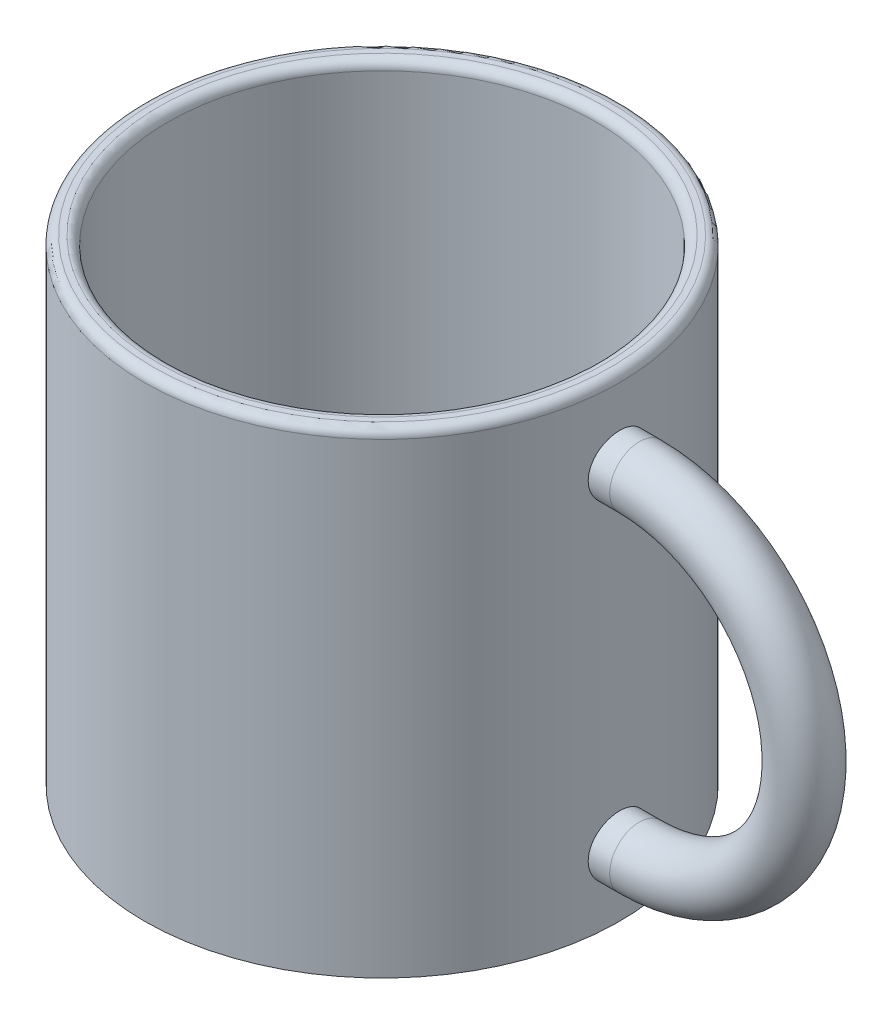
ISO-10303-21;
HEADER;
FILE_DESCRIPTION(('STEP AP214'),'2;1');
FILE_NAME('part.step','',(''),(''),'','','');
FILE_SCHEMA(('AUTOMOTIVE_DESIGN { 1 0 10303 214 1 1 1 1 }'));
ENDSEC;
DATA;
#1=APPLICATION_CONTEXT('core data for automotive mechanical design processes');
#2=APPLICATION_PROTOCOL_DEFINITION('international standard','automotive_design',2000,#1);
#3=PRODUCT_CONTEXT('',#1,'mechanical');
#4=PRODUCT('Part','Part','',(#3));
#5=PRODUCT_RELATED_PRODUCT_CATEGORY('part','',(#4));
#6=PRODUCT_DEFINITION_FORMATION('','',#4);
#7=PRODUCT_DEFINITION_CONTEXT('part definition',#1,'design');
#8=PRODUCT_DEFINITION('design','',#6,#7);
#9=PRODUCT_DEFINITION_SHAPE('','',#8);
#10=(LENGTH_UNIT() NAMED_UNIT(*) SI_UNIT(.MILLI.,.METRE.));
#11=(NAMED_UNIT(*) PLANE_ANGLE_UNIT() SI_UNIT($,.RADIAN.));
#12=(NAMED_UNIT(*) SI_UNIT($,.STERADIAN.) SOLID_ANGLE_UNIT());
#13=UNCERTAINTY_MEASURE_WITH_UNIT(LENGTH_MEASURE(1.E-05),#10,'distance_accuracy_value','');
#14=(GEOMETRIC_REPRESENTATION_CONTEXT(3) GLOBAL_UNCERTAINTY_ASSIGNED_CONTEXT((#13)) GLOBAL_UNIT_ASSIGNED_CONTEXT((#10,
#11,#12)) REPRESENTATION_CONTEXT('',''));
#15=CARTESIAN_POINT('',(0.,0.,0.));
#16=DIRECTION('',(0.,0.,1.));
#17=DIRECTION('',(1.,0.,0.));
#18=AXIS2_PLACEMENT_3D('',#15,#16,#17);
#19=CARTESIAN_POINT('',(-1.76082079814359,58.5636991900341,2.01932129809792E-06));
#20=DIRECTION('',(0.,-1.,0.));
#21=DIRECTION('',(0.,0.,-1.));
#22=AXIS2_PLACEMENT_3D('',#19,#20,#21);
#23=CYLINDRICAL_SURFACE('',#22,36.);
#24=CARTESIAN_POINT('',(-1.76082079814359,57.2136991900341,2.01932129809792E-06));
#25=DIRECTION('',(0.,1.,0.));
#26=DIRECTION('',(0.,0.,1.));
#27=AXIS2_PLACEMENT_3D('',#24,#25,#26);
#28=CIRCLE('',#27,36.);
#29=CARTESIAN_POINT('',(-1.76082079814359,57.2136991900341,36.0000020193213));
#30=VERTEX_POINT('',#29);
#31=EDGE_CURVE('E49',#30,#30,#28,.F.);
#32=ORIENTED_EDGE('',*,*,#31,.T.);
#33=EDGE_LOOP('',(#32));
#34=FACE_BOUND('',#33,.T.);
#35=CARTESIAN_POINT('',(33.9568219012284,-3.44089809503379,4.5000020193213));
#36=CARTESIAN_POINT('',(33.9568255164976,-3.18919278419296,4.49999131802138));
#37=CARTESIAN_POINT('',(33.9595113118363,-2.9373301581587,4.47881223755117));
#38=CARTESIAN_POINT('',(33.969960237254,-2.44061428926255,4.3946595640113));
#39=CARTESIAN_POINT('',(33.977728672829,-2.19576865013058,4.33164229728475));
#40=CARTESIAN_POINT('',(33.9974495304141,-1.72035030724008,4.16570006641122));
#41=CARTESIAN_POINT('',(34.0093991121829,-1.48976803922425,4.06280218795899));
#42=CARTESIAN_POINT('',(34.036132425054,-1.04918688174818,3.82007757649359));
#43=CARTESIAN_POINT('',(34.0509156715303,-0.839184481895194,3.68025715659569));
#44=CARTESIAN_POINT('',(34.08174326829,-0.444506050215049,3.36681822979748));
#45=CARTESIAN_POINT('',(34.0977935525048,-0.259961850860085,3.1930342863651));
#46=CARTESIAN_POINT('',(34.1292933936098,0.0774228890568443,2.81695748852945));
#47=CARTESIAN_POINT('',(34.1447429205822,0.230261852336736,2.61466321662574));
#48=CARTESIAN_POINT('',(34.1733612048903,0.500370348077595,2.18647971453806));
#49=CARTESIAN_POINT('',(34.1865222510998,0.617520586145584,1.96051467133131));
#50=CARTESIAN_POINT('',(34.2090154670371,0.812162064859977,1.49192611182194));
#51=CARTESIAN_POINT('',(34.2183477788696,0.889654777433953,1.24930321417093));
#52=CARTESIAN_POINT('',(34.2320902385687,1.00238762796818,0.755634257273301));
#53=CARTESIAN_POINT('',(34.2365259089034,1.03784692630922,0.504638966715378));
#54=CARTESIAN_POINT('',(34.2400624569823,1.06618559803199,0.000223780557080926));
#55=CARTESIAN_POINT('',(34.2391635445938,1.05906664648079,-0.253196019269291));
#56=CARTESIAN_POINT('',(34.2321528617166,1.00262654000285,-0.753775464832889));
#57=CARTESIAN_POINT('',(34.2260702060595,0.95354108769974,-1.00096215105472));
#58=CARTESIAN_POINT('',(34.2094082088184,0.814929787032335,-1.48356187570838));
#59=CARTESIAN_POINT('',(34.1988287817492,0.725403169865922,-1.71897469021987));
#60=CARTESIAN_POINT('',(34.1743118423989,0.508200217955404,-2.17207384846825));
#61=CARTESIAN_POINT('',(34.1603653710347,0.38042188105189,-2.38971079079164));
#62=CARTESIAN_POINT('',(34.1306746450315,0.0904168529773623,-2.80054139483036));
#63=CARTESIAN_POINT('',(34.1149303079571,-0.0718114180772167,-2.99373393486995));
#64=CARTESIAN_POINT('',(34.0832788172796,-0.427431368510873,-3.35157643607001));
#65=CARTESIAN_POINT('',(34.0673712863415,-0.621028462217781,-3.5160222926715));
#66=CARTESIAN_POINT('',(34.0372924967868,-1.0331848972422,-3.8101171118039));
#67=CARTESIAN_POINT('',(34.0231212436128,-1.25174431680229,-3.93976596526188));
#68=CARTESIAN_POINT('',(33.9981196488853,-1.70780318704597,-4.16059821312763));
#69=CARTESIAN_POINT('',(33.9872907282028,-1.94531063894955,-4.25176525443089));
#70=CARTESIAN_POINT('',(33.9702275667836,-2.43242911138208,-4.39286495872126));
#71=CARTESIAN_POINT('',(33.9639931046171,-2.68203954798948,-4.44279960891802));
#72=CARTESIAN_POINT('',(33.9568651999693,-3.18447582263336,-4.4997467581142));
#73=CARTESIAN_POINT('',(33.9559360158192,-3.43726861659361,-4.50704649627562));
#74=CARTESIAN_POINT('',(33.9594293420101,-3.94047356843153,-4.47927449649371));
#75=CARTESIAN_POINT('',(33.9638517382825,-4.19088577693655,-4.44420366167636));
#76=CARTESIAN_POINT('',(33.9775173145681,-4.68136046947394,-4.33292789511461));
#77=CARTESIAN_POINT('',(33.9867441903603,-4.92145500237652,-4.25686205142161));
#78=CARTESIAN_POINT('',(34.0089658613309,-5.38548157376947,-4.06589867508774));
#79=CARTESIAN_POINT('',(34.0219607888901,-5.60941304406735,-3.95099977812491));
#80=CARTESIAN_POINT('',(34.0503399662146,-6.03605645389717,-3.68492562055756));
#81=CARTESIAN_POINT('',(34.0657364711239,-6.23865009259975,-3.5335619959175));
#82=CARTESIAN_POINT('',(34.0971455137748,-6.61565989211684,-3.19912131694282));
#83=CARTESIAN_POINT('',(34.1131580754596,-6.79007495639616,-3.01604302904457));
#84=CARTESIAN_POINT('',(34.1441047982217,-7.10678563223572,-2.62211517668404));
#85=CARTESIAN_POINT('',(34.1590322922818,-7.24889249926477,-2.41111326648936));
#86=CARTESIAN_POINT('',(34.1860272364254,-7.49564688677462,-1.96806862770592));
#87=CARTESIAN_POINT('',(34.1980947441553,-7.60029516229954,-1.73602632334168));
#88=CARTESIAN_POINT('',(34.2179804336138,-7.76885011146824,-1.25811492712972));
#89=CARTESIAN_POINT('',(34.225809984235,-7.83286586789069,-1.0122848003999));
#90=CARTESIAN_POINT('',(34.2363847860526,-7.91869345564195,-0.513260883779028));
#91=CARTESIAN_POINT('',(34.2391302665198,-7.9405071901124,-0.26006742646729));
#92=CARTESIAN_POINT('',(34.2392265061022,-7.94127595515967,0.244652949340107));
#93=CARTESIAN_POINT('',(34.2366138988768,-7.92052202405617,0.496179467207807));
#94=CARTESIAN_POINT('',(34.2263603427,-7.83736099085826,0.992139953936017));
#95=CARTESIAN_POINT('',(34.2187193972456,-7.77495391773251,1.23657392772908));
#96=CARTESIAN_POINT('',(34.1992639356704,-7.61034948920445,1.71137261669842));
#97=CARTESIAN_POINT('',(34.1874508816672,-7.50816607216241,1.94174222760833));
#98=CARTESIAN_POINT('',(34.1609592587791,-7.26693972873977,2.38211002618074));
#99=CARTESIAN_POINT('',(34.1462806558286,-7.12789636416117,2.59210797162049));
#100=CARTESIAN_POINT('',(34.1155766924805,-6.81582030742988,2.98725820165317));
#101=CARTESIAN_POINT('',(34.0995431447411,-6.64257106669712,3.17223883742028));
#102=CARTESIAN_POINT('',(34.068002064236,-6.26745079577593,3.51061603319888));
#103=CARTESIAN_POINT('',(34.0524946569697,-6.06557299552811,3.66400510135987));
#104=CARTESIAN_POINT('',(34.0236978064513,-5.63803223419719,3.93535145584204));
#105=CARTESIAN_POINT('',(34.010417159493,-5.41228043322605,4.05316962898663));
#106=CARTESIAN_POINT('',(33.9876806461809,-4.94415596203924,4.24905553830476));
#107=CARTESIAN_POINT('',(33.9782206222651,-4.7018016963076,4.32716650752439));
#108=CARTESIAN_POINT('',(33.9664933648563,-4.28864411834526,4.42272063255421));
#109=CARTESIAN_POINT('',(33.9628846292365,-4.12044678226224,4.4516594751413));
#110=CARTESIAN_POINT('',(33.9580476820091,-3.78182304509723,4.49030371995026));
#111=CARTESIAN_POINT('',(33.9568194523399,-3.61139666093754,4.50000926810077));
#112=CARTESIAN_POINT('',(33.9568219012284,-3.44089809503379,4.5000020193213));
#113=B_SPLINE_CURVE_WITH_KNOTS('',3,(#35,#36,#37,#38,#39,#40,#41,#42,#43,#44,#45,#46,#47,#48,
#49,#50,#51,#52,#53,#54,#55,#56,#57,#58,#59,#60,#61,#62,#63,#64,#65,#66,#67,#68,#69,#70,#71,#72,
#73,#74,#75,#76,#77,#78,#79,#80,#81,#82,#83,#84,#85,#86,#87,#88,#89,#90,#91,#92,#93,#94,#95,#96,
#97,#98,#99,#100,#101,#102,#103,#104,#105,#106,#107,#108,#109,#110,#111,#112),.UNSPECIFIED.,.T.,
.F.,(4,2,2,2,2,2,2,2,2,2,2,2,2,2,2,2,2,2,2,2,2,2,2,2,2,2,2,2,2,2,2,2,2,2,2,2,2,2,4),(0.,
0.754493071484989,1.50977497711771,2.26454481468959,3.01918568315446,3.77759839592661,
4.53604882940985,5.29700735066676,6.05793762616037,6.81488274498966,7.57179808510538,
8.32448996883812,9.07719616213564,9.8319276794739,10.5866938164873,11.3466185528433,
12.1065456711931,12.8667954013456,13.6270084888548,14.3820939205493,15.1371632579315,
15.8896867733126,16.6422367298568,17.3987607518374,18.15531420595,18.9161799461056,
19.6770303488032,20.4358294221724,21.194594275954,21.948188693232,22.7017825864056,
23.4551126438371,24.2084516573999,24.9667223200785,25.7251725979604,26.4865517587428,
27.2471001477468,27.7581778134636,28.2692516014691),.UNSPECIFIED.);
#114=CARTESIAN_POINT('',(33.9568219012284,-3.44089809503379,4.5000020193213));
#115=VERTEX_POINT('',#114);
#116=EDGE_CURVE('E61',#115,#115,#113,.T.);
#117=ORIENTED_EDGE('',*,*,#116,.T.);
#118=EDGE_LOOP('',(#117));
#119=FACE_BOUND('',#118,.T.);
#120=CARTESIAN_POINT('',(-1.76082079814359,-13.4363008099659,2.01932129809792E-06));
#121=DIRECTION('',(0.,1.,0.));
#122=DIRECTION('',(0.,0.,1.));
#123=AXIS2_PLACEMENT_3D('',#120,#121,#122);
#124=CIRCLE('',#123,36.);
#125=CARTESIAN_POINT('',(-1.76082079814359,-13.4363008099659,36.0000020193213));
#126=VERTEX_POINT('',#125);
#127=EDGE_CURVE('E67',#126,#126,#124,.T.);
#128=ORIENTED_EDGE('',*,*,#127,.T.);
#129=EDGE_LOOP('',(#128));
#130=FACE_BOUND('',#129,.T.);
#131=CARTESIAN_POINT('',(33.9568219012284,46.4551019049662,4.5000020193213));
#132=CARTESIAN_POINT('',(33.9568255164976,46.2033965941254,4.49999131802138));
#133=CARTESIAN_POINT('',(33.9595113118363,45.9515339680911,4.47881223755117));
#134=CARTESIAN_POINT('',(33.969960237254,45.454818099195,4.3946595640113));
#135=CARTESIAN_POINT('',(33.977728672829,45.209972460063,4.33164229728475));
#136=CARTESIAN_POINT('',(33.9974495304141,44.7345541171725,4.16570006641122));
#137=CARTESIAN_POINT('',(34.0093991121829,44.5039718491567,4.06280218795899));
#138=CARTESIAN_POINT('',(34.036132425054,44.0633906916806,3.82007757649359));
#139=CARTESIAN_POINT('',(34.0509156715303,43.8533882918276,3.68025715659569));
#140=CARTESIAN_POINT('',(34.08174326829,43.4587098601475,3.36681822979748));
#141=CARTESIAN_POINT('',(34.0977935525048,43.2741656607925,3.1930342863651));
#142=CARTESIAN_POINT('',(34.1292933936098,42.9367809208756,2.81695748852945));
#143=CARTESIAN_POINT('',(34.1447429205822,42.7839419575957,2.61466321662575));
#144=CARTESIAN_POINT('',(34.1733612048903,42.5138334618548,2.18647971453807));
#145=CARTESIAN_POINT('',(34.1865222510998,42.3966832237869,1.96051467133131));
#146=CARTESIAN_POINT('',(34.2090154670371,42.2020417450725,1.49192611182195));
#147=CARTESIAN_POINT('',(34.2183477788696,42.1245490324985,1.24930321417093));
#148=CARTESIAN_POINT('',(34.2320902385687,42.0118161819642,0.755634257273308));
#149=CARTESIAN_POINT('',(34.2365259089034,41.9763568836232,0.504638966715384));
#150=CARTESIAN_POINT('',(34.2400624569823,41.9480182119004,0.000223780557086618));
#151=CARTESIAN_POINT('',(34.2391635445938,41.9551371634516,-0.253196019269285));
#152=CARTESIAN_POINT('',(34.2321528617166,42.0115772699296,-0.753775464832882));
#153=CARTESIAN_POINT('',(34.2260702060595,42.0606627222327,-1.00096215105471));
#154=CARTESIAN_POINT('',(34.2094082088184,42.1992740229001,-1.48356187570837));
#155=CARTESIAN_POINT('',(34.1988287817492,42.2888006400665,-1.71897469021987));
#156=CARTESIAN_POINT('',(34.1743118423989,42.506003591977,-2.17207384846825));
#157=CARTESIAN_POINT('',(34.1603653710347,42.6337819288805,-2.38971079079163));
#158=CARTESIAN_POINT('',(34.1306746450315,42.9237869569551,-2.80054139483036));
#159=CARTESIAN_POINT('',(34.1149303079571,43.0860152280096,-2.99373393486994));
#160=CARTESIAN_POINT('',(34.0832788172796,43.4416351784433,-3.35157643607));
#161=CARTESIAN_POINT('',(34.0673712863415,43.6352322721502,-3.51602229267149));
#162=CARTESIAN_POINT('',(34.0372924967868,44.0473887071746,-3.81011711180389));
#163=CARTESIAN_POINT('',(34.0231212436128,44.2659481267347,-3.93976596526187));
#164=CARTESIAN_POINT('',(33.9981196488853,44.7220069969784,-4.16059821312763));
#165=CARTESIAN_POINT('',(33.9872907282028,44.959514448882,-4.25176525443089));
#166=CARTESIAN_POINT('',(33.9702275667836,45.4466329213145,-4.39286495872126));
#167=CARTESIAN_POINT('',(33.9639931046171,45.6962433579219,-4.44279960891802));
#168=CARTESIAN_POINT('',(33.9568651999693,46.1986796325658,-4.4997467581142));
#169=CARTESIAN_POINT('',(33.9559360158192,46.451472426526,-4.50704649627562));
#170=CARTESIAN_POINT('',(33.9594293420101,46.9546773783639,-4.47927449649371));
#171=CARTESIAN_POINT('',(33.9638517382825,47.205089586869,-4.44420366167636));
#172=CARTESIAN_POINT('',(33.9775173145681,47.6955642794064,-4.33292789511462));
#173=CARTESIAN_POINT('',(33.9867441903603,47.9356588123089,-4.25686205142162));
#174=CARTESIAN_POINT('',(34.0089658613309,48.3996853837019,-4.06589867508774));
#175=CARTESIAN_POINT('',(34.0219607888901,48.6236168539998,-3.95099977812492));
#176=CARTESIAN_POINT('',(34.0503399662146,49.0502602638296,-3.68492562055757));
#177=CARTESIAN_POINT('',(34.0657364711239,49.2528539025322,-3.5335619959175));
#178=CARTESIAN_POINT('',(34.0971455137748,49.6298637020493,-3.19912131694283));
#179=CARTESIAN_POINT('',(34.1131580754596,49.8042787663286,-3.01604302904457));
#180=CARTESIAN_POINT('',(34.1441047982217,50.1209894421681,-2.62211517668404));
#181=CARTESIAN_POINT('',(34.1590322922818,50.2630963091972,-2.41111326648937));
#182=CARTESIAN_POINT('',(34.1860272364254,50.509850696707,-1.96806862770593));
#183=CARTESIAN_POINT('',(34.1980947441553,50.614498972232,-1.73602632334168));
#184=CARTESIAN_POINT('',(34.2179804336138,50.7830539214007,-1.25811492712972));
#185=CARTESIAN_POINT('',(34.225809984235,50.8470696778231,-1.01228480039991));
#186=CARTESIAN_POINT('',(34.2363847860526,50.9328972655744,-0.513260883779037));
#187=CARTESIAN_POINT('',(34.2391302665198,50.9547110000448,-0.2600674264673));
#188=CARTESIAN_POINT('',(34.2392265061022,50.9554797650921,0.244652949340095));
#189=CARTESIAN_POINT('',(34.2366138988768,50.9347258339886,0.496179467207796));
#190=CARTESIAN_POINT('',(34.2263603427,50.8515648007907,0.992139953936007));
#191=CARTESIAN_POINT('',(34.2187193972456,50.7891577276649,1.23657392772907));
#192=CARTESIAN_POINT('',(34.1992639356704,50.6245532991369,1.71137261669841));
#193=CARTESIAN_POINT('',(34.1874508816672,50.5223698820948,1.94174222760833));
#194=CARTESIAN_POINT('',(34.1609592587791,50.2811435386722,2.38211002618073));
#195=CARTESIAN_POINT('',(34.1462806558286,50.1421001740936,2.59210797162048));
#196=CARTESIAN_POINT('',(34.1155766924805,49.8300241173623,2.98725820165316));
#197=CARTESIAN_POINT('',(34.0995431447411,49.6567748766296,3.17223883742028));
#198=CARTESIAN_POINT('',(34.068002064236,49.2816546057084,3.51061603319887));
#199=CARTESIAN_POINT('',(34.0524946569697,49.0797768054606,3.66400510135986));
#200=CARTESIAN_POINT('',(34.0236978064513,48.6522360441296,3.93535145584204));
#201=CARTESIAN_POINT('',(34.010417159493,48.4264842431585,4.05316962898663));
#202=CARTESIAN_POINT('',(33.9876806461809,47.9583597719717,4.24905553830476));
#203=CARTESIAN_POINT('',(33.9782206222651,47.71600550624,4.32716650752438));
#204=CARTESIAN_POINT('',(33.9664933648563,47.3028479282777,4.4227206325542));
#205=CARTESIAN_POINT('',(33.9628846292365,47.1346505921947,4.4516594751413));
#206=CARTESIAN_POINT('',(33.9580476820091,46.7960268550297,4.49030371995026));
#207=CARTESIAN_POINT('',(33.9568194523399,46.62560047087,4.50000926810077));
#208=CARTESIAN_POINT('',(33.9568219012284,46.4551019049662,4.5000020193213));
#209=B_SPLINE_CURVE_WITH_KNOTS('',3,(#131,#132,#133,#134,#135,#136,#137,#138,#139,#140,#141,
#142,#143,#144,#145,#146,#147,#148,#149,#150,#151,#152,#153,#154,#155,#156,#157,#158,#159,#160,
#161,#162,#163,#164,#165,#166,#167,#168,#169,#170,#171,#172,#173,#174,#175,#176,#177,#178,#179,
#180,#181,#182,#183,#184,#185,#186,#187,#188,#189,#190,#191,#192,#193,#194,#195,#196,#197,#198,
#199,#200,#201,#202,#203,#204,#205,#206,#207,#208),.UNSPECIFIED.,.T.,.F.,(4,2,2,2,2,2,2,2,2,2,2,
2,2,2,2,2,2,2,2,2,2,2,2,2,2,2,2,2,2,2,2,2,2,2,2,2,2,2,4),(0.,0.754493071484989,1.50977497711771,
2.26454481468958,3.01918568315445,3.77759839592661,4.53604882940984,5.29700735066676,
6.05793762616037,6.81488274498966,7.57179808510538,8.32448996883812,9.07719616213563,
9.8319276794739,10.5866938164873,11.3466185528433,12.1065456711931,12.8667954013456,
13.6270084888548,14.3820939205493,15.1371632579315,15.8896867733126,16.6422367298568,
17.3987607518374,18.15531420595,18.9161799461056,19.6770303488032,20.4358294221724,
21.194594275954,21.948188693232,22.7017825864056,23.4551126438371,24.2084516573999,
24.9667223200785,25.7251725979604,26.4865517587428,27.2471001477468,27.7581778134636,
28.2692516014691),.UNSPECIFIED.);
#210=CARTESIAN_POINT('',(33.9568219012284,46.4551019049662,4.5000020193213));
#211=VERTEX_POINT('',#210);
#212=EDGE_CURVE('E60',#211,#211,#209,.T.);
#213=ORIENTED_EDGE('',*,*,#212,.F.);
#214=EDGE_LOOP('',(#213));
#215=FACE_BOUND('',#214,.T.);
#216=ADVANCED_FACE('F34',(#34,#119,#130,#215),#23,.T.);
#217=CARTESIAN_POINT('',(-1.76082079814359,58.5636991900341,2.01932129809792E-06));
#218=DIRECTION('',(0.,1.,0.));
#219=DIRECTION('',(0.,0.,1.));
#220=AXIS2_PLACEMENT_3D('',#217,#218,#219);
#221=PLANE('',#220);
#222=CARTESIAN_POINT('',(-1.76082079814359,58.5636991900341,2.01932129809792E-06));
#223=DIRECTION('',(0.,1.,0.));
#224=DIRECTION('',(0.,0.,1.));
#225=AXIS2_PLACEMENT_3D('',#222,#223,#224);
#226=CIRCLE('',#225,34.65);
#227=CARTESIAN_POINT('',(-1.76082079814359,58.5636991900341,34.6500020193213));
#228=VERTEX_POINT('',#227);
#229=EDGE_CURVE('E54',#228,#228,#226,.T.);
#230=ORIENTED_EDGE('',*,*,#229,.T.);
#231=EDGE_LOOP('',(#230));
#232=FACE_BOUND('',#231,.T.);
#233=CARTESIAN_POINT('',(-1.76082079814359,58.5636991900341,2.01932129809792E-06));
#234=DIRECTION('',(0.,1.,0.));
#235=DIRECTION('',(0.,0.,1.));
#236=AXIS2_PLACEMENT_3D('',#233,#234,#235);
#237=CIRCLE('',#236,33.75);
#238=CARTESIAN_POINT('',(-1.76082079814359,58.5636991900341,33.7500020193213));
#239=VERTEX_POINT('',#238);
#240=EDGE_CURVE('E57',#239,#239,#237,.F.);
#241=ORIENTED_EDGE('',*,*,#240,.T.);
#242=EDGE_LOOP('',(#241));
#243=FACE_BOUND('',#242,.T.);
#244=ADVANCED_FACE('F83',(#232,#243),#221,.T.);
#245=CARTESIAN_POINT('',(-1.76082079814359,-13.4363008099659,2.01932129809792E-06));
#246=DIRECTION('',(0.,1.,0.));
#247=DIRECTION('',(0.,0.,1.));
#248=AXIS2_PLACEMENT_3D('',#245,#246,#247);
#249=PLANE('',#248);
#250=ORIENTED_EDGE('',*,*,#127,.F.);
#251=EDGE_LOOP('',(#250));
#252=FACE_BOUND('',#251,.T.);
#253=ADVANCED_FACE('F79',(#252),#249,.F.);
#254=CARTESIAN_POINT('',(37.2091792018564,-3.44089809503379,2.01932129809792E-06));
#255=DIRECTION('',(-1.,0.,0.));
#256=DIRECTION('',(0.,0.,1.));
#257=AXIS2_PLACEMENT_3D('',#254,#255,#256);
#258=CYLINDRICAL_SURFACE('',#257,4.5);
#259=CARTESIAN_POINT('',(37.2091792018564,-3.44089809503379,2.01932129809792E-06));
#260=DIRECTION('',(-1.,0.,0.));
#261=DIRECTION('',(0.,0.,-1.));
#262=AXIS2_PLACEMENT_3D('',#259,#260,#261);
#263=CIRCLE('',#262,4.5);
#264=CARTESIAN_POINT('',(37.2091792018564,-7.94089809503379,2.01932129809792E-06));
#265=VERTEX_POINT('',#264);
#266=EDGE_CURVE('E68',#265,#265,#263,.T.);
#267=ORIENTED_EDGE('',*,*,#266,.T.);
#268=EDGE_LOOP('',(#267));
#269=FACE_BOUND('',#268,.T.);
#270=ORIENTED_EDGE('',*,*,#116,.F.);
#271=EDGE_LOOP('',(#270));
#272=FACE_BOUND('',#271,.T.);
#273=ADVANCED_FACE('F73',(#269,#272),#258,.T.);
#274=CARTESIAN_POINT('',(37.2091792018564,46.4551019049662,2.01932129809792E-06));
#275=DIRECTION('',(-1.,0.,0.));
#276=DIRECTION('',(0.,0.,1.));
#277=AXIS2_PLACEMENT_3D('',#274,#275,#276);
#278=CYLINDRICAL_SURFACE('',#277,4.5);
#279=CARTESIAN_POINT('',(37.2091792018564,46.4551019049662,2.01932129809792E-06));
#280=DIRECTION('',(1.,0.,0.));
#281=DIRECTION('',(0.,0.,-1.));
#282=AXIS2_PLACEMENT_3D('',#279,#280,#281);
#283=CIRCLE('',#282,4.5);
#284=CARTESIAN_POINT('',(37.2091792018564,50.9551019049662,2.01932129809792E-06));
#285=VERTEX_POINT('',#284);
#286=EDGE_CURVE('E122',#285,#285,#283,.T.);
#287=ORIENTED_EDGE('',*,*,#286,.F.);
#288=EDGE_LOOP('',(#287));
#289=FACE_BOUND('',#288,.T.);
#290=ORIENTED_EDGE('',*,*,#212,.T.);
#291=EDGE_LOOP('',(#290));
#292=FACE_BOUND('',#291,.T.);
#293=ADVANCED_FACE('F78',(#289,#292),#278,.T.);
#294=CARTESIAN_POINT('',(37.2091792018564,21.5071019049662,2.01932129809792E-06));
#295=DIRECTION('',(0.,0.,-1.));
#296=DIRECTION('',(-1.,0.,0.));
#297=AXIS2_PLACEMENT_3D('',#294,#295,#296);
#298=TOROIDAL_SURFACE('',#297,24.948,4.5);
#299=CARTESIAN_POINT('',(37.2091792018564,21.5071019049662,2.01932129809792E-06));
#300=DIRECTION('',(0.,0.,-1.));
#301=DIRECTION('',(-1.,0.,0.));
#302=AXIS2_PLACEMENT_3D('',#299,#300,#301);
#303=CIRCLE('',#302,29.448);
#304=EDGE_CURVE('',#285,#265,#303,.T.);
#305=ORIENTED_EDGE('',*,*,#286,.T.);
#306=ORIENTED_EDGE('',*,*,#266,.F.);
#307=ORIENTED_EDGE('',*,*,#304,.T.);
#308=ORIENTED_EDGE('',*,*,#304,.F.);
#309=EDGE_LOOP('',(#305,#307,#306,#308));
#310=FACE_BOUND('',#309,.T.);
#311=ADVANCED_FACE('F81',(#310),#298,.T.);
#312=CARTESIAN_POINT('',(-1.76082079814359,-105.077339651742,2.01932129809792E-06));
#313=DIRECTION('',(0.,1.,0.));
#314=DIRECTION('',(0.,0.,1.));
#315=AXIS2_PLACEMENT_3D('',#312,#313,#314);
#316=CYLINDRICAL_SURFACE('',#315,32.4);
#317=CARTESIAN_POINT('',(-1.76082079814359,-8.4863008099659,2.01932129809792E-06));
#318=DIRECTION('',(0.,1.,0.));
#319=DIRECTION('',(0.,0.,1.));
#320=AXIS2_PLACEMENT_3D('',#317,#318,#319);
#321=CIRCLE('',#320,32.4);
#322=CARTESIAN_POINT('',(-1.76082079814359,-8.4863008099659,32.4000020193213));
#323=VERTEX_POINT('',#322);
#324=EDGE_CURVE('E41',#323,#323,#321,.F.);
#325=ORIENTED_EDGE('',*,*,#324,.T.);
#326=EDGE_LOOP('',(#325));
#327=FACE_BOUND('',#326,.T.);
#328=CARTESIAN_POINT('',(-1.76082079814359,57.2136991900341,2.01932129809792E-06));
#329=DIRECTION('',(0.,1.,0.));
#330=DIRECTION('',(0.,0.,1.));
#331=AXIS2_PLACEMENT_3D('',#328,#329,#330);
#332=CIRCLE('',#331,32.4);
#333=CARTESIAN_POINT('',(-1.76082079814359,57.2136991900341,32.4000020193213));
#334=VERTEX_POINT('',#333);
#335=EDGE_CURVE('E45',#334,#334,#332,.T.);
#336=ORIENTED_EDGE('',*,*,#335,.T.);
#337=EDGE_LOOP('',(#336));
#338=FACE_BOUND('',#337,.T.);
#339=ADVANCED_FACE('F103',(#327,#338),#316,.F.);
#340=CARTESIAN_POINT('',(-1.76082079814359,-9.83630080996591,2.01932129809792E-06));
#341=DIRECTION('',(0.,1.,0.));
#342=DIRECTION('',(0.,0.,1.));
#343=AXIS2_PLACEMENT_3D('',#340,#341,#342);
#344=PLANE('',#343);
#345=CARTESIAN_POINT('',(-1.76082079814359,-9.83630080996591,2.01932129809792E-06));
#346=DIRECTION('',(0.,1.,0.));
#347=DIRECTION('',(0.,0.,1.));
#348=AXIS2_PLACEMENT_3D('',#345,#346,#347);
#349=CIRCLE('',#348,31.05);
#350=CARTESIAN_POINT('',(-1.76082079814359,-9.83630080996591,31.0500020193213));
#351=VERTEX_POINT('',#350);
#352=EDGE_CURVE('E11',#351,#351,#349,.T.);
#353=ORIENTED_EDGE('',*,*,#352,.T.);
#354=EDGE_LOOP('',(#353));
#355=FACE_BOUND('',#354,.T.);
#356=ADVANCED_FACE('F105',(#355),#344,.T.);
#357=CARTESIAN_POINT('',(-1.76082079814359,57.2136991900341,2.01932129809792E-06));
#358=DIRECTION('',(0.,1.,0.));
#359=DIRECTION('',(0.,0.,1.));
#360=AXIS2_PLACEMENT_3D('',#357,#358,#359);
#361=TOROIDAL_SURFACE('',#360,34.65,1.35);
#362=ORIENTED_EDGE('',*,*,#31,.F.);
#363=EDGE_LOOP('',(#362));
#364=FACE_BOUND('',#363,.T.);
#365=ORIENTED_EDGE('',*,*,#229,.F.);
#366=EDGE_LOOP('',(#365));
#367=FACE_BOUND('',#366,.T.);
#368=ADVANCED_FACE('F99',(#364,#367),#361,.T.);
#369=CARTESIAN_POINT('',(-1.76082079814359,57.2136991900341,2.01932129809792E-06));
#370=DIRECTION('',(0.,1.,0.));
#371=DIRECTION('',(0.,0.,1.));
#372=AXIS2_PLACEMENT_3D('',#369,#370,#371);
#373=TOROIDAL_SURFACE('',#372,33.75,1.35);
#374=ORIENTED_EDGE('',*,*,#240,.F.);
#375=EDGE_LOOP('',(#374));
#376=FACE_BOUND('',#375,.T.);
#377=ORIENTED_EDGE('',*,*,#335,.F.);
#378=EDGE_LOOP('',(#377));
#379=FACE_BOUND('',#378,.T.);
#380=ADVANCED_FACE('F95',(#376,#379),#373,.T.);
#381=CARTESIAN_POINT('',(-1.76082079814359,-8.4863008099659,2.01932129809792E-06));
#382=DIRECTION('',(0.,1.,0.));
#383=DIRECTION('',(0.,0.,1.));
#384=AXIS2_PLACEMENT_3D('',#381,#382,#383);
#385=TOROIDAL_SURFACE('',#384,31.05,1.35);
#386=ORIENTED_EDGE('',*,*,#352,.F.);
#387=EDGE_LOOP('',(#386));
#388=FACE_BOUND('',#387,.T.);
#389=ORIENTED_EDGE('',*,*,#324,.F.);
#390=EDGE_LOOP('',(#389));
#391=FACE_BOUND('',#390,.T.);
#392=ADVANCED_FACE('F98',(#388,#391),#385,.F.);
#393=CLOSED_SHELL('',(#216,#244,#253,#273,#293,#311,#339,#356,#368,#380,#392));
#394=MANIFOLD_SOLID_BREP('B2',#393);
#395=ADVANCED_BREP_SHAPE_REPRESENTATION('',(#18,#394),#14);
#396=SHAPE_DEFINITION_REPRESENTATION(#9,#395);
ENDSEC;
END-ISO-10303-21;
